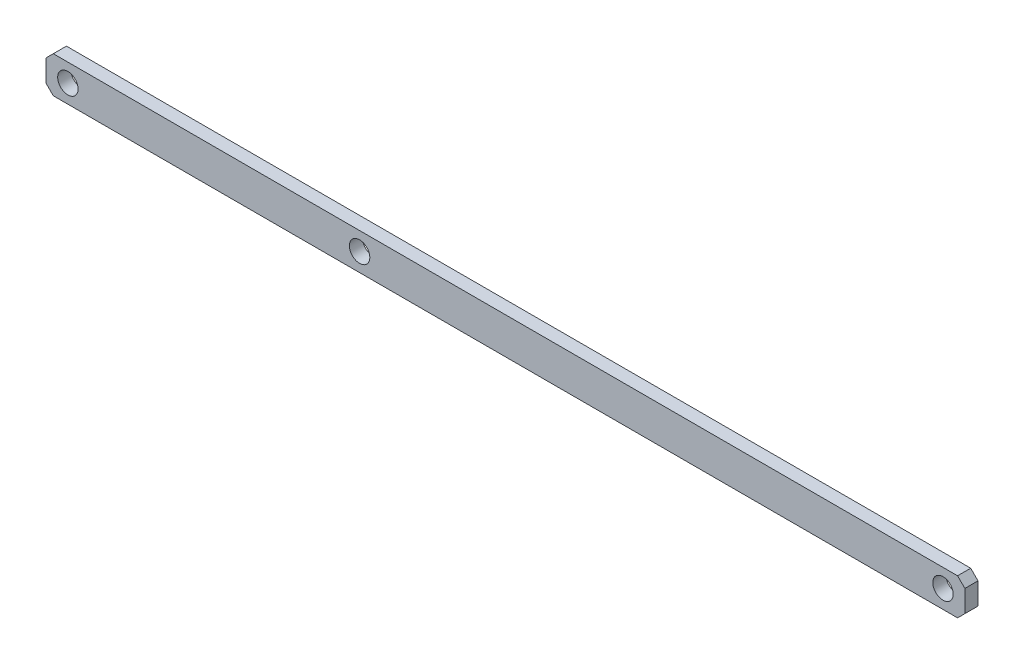
ISO-10303-21;
HEADER;
FILE_DESCRIPTION(('STEP AP214'),'2;1');
FILE_NAME('part.step','',(''),(''),'','','');
FILE_SCHEMA(('AUTOMOTIVE_DESIGN { 1 0 10303 214 1 1 1 1 }'));
ENDSEC;
DATA;
#1=APPLICATION_CONTEXT('core data for automotive mechanical design processes');
#2=APPLICATION_PROTOCOL_DEFINITION('international standard','automotive_design',2000,#1);
#3=PRODUCT_CONTEXT('',#1,'mechanical');
#4=PRODUCT('Part','Part','',(#3));
#5=PRODUCT_RELATED_PRODUCT_CATEGORY('part','',(#4));
#6=PRODUCT_DEFINITION_FORMATION('','',#4);
#7=PRODUCT_DEFINITION_CONTEXT('part definition',#1,'design');
#8=PRODUCT_DEFINITION('design','',#6,#7);
#9=PRODUCT_DEFINITION_SHAPE('','',#8);
#10=(LENGTH_UNIT() NAMED_UNIT(*) SI_UNIT(.MILLI.,.METRE.));
#11=(NAMED_UNIT(*) PLANE_ANGLE_UNIT() SI_UNIT($,.RADIAN.));
#12=(NAMED_UNIT(*) SI_UNIT($,.STERADIAN.) SOLID_ANGLE_UNIT());
#13=UNCERTAINTY_MEASURE_WITH_UNIT(LENGTH_MEASURE(1.E-05),#10,'distance_accuracy_value','');
#14=(GEOMETRIC_REPRESENTATION_CONTEXT(3) GLOBAL_UNCERTAINTY_ASSIGNED_CONTEXT((#13)) GLOBAL_UNIT_ASSIGNED_CONTEXT((#10,
#11,#12)) REPRESENTATION_CONTEXT('',''));
#15=CARTESIAN_POINT('',(0.,0.,0.));
#16=DIRECTION('',(0.,0.,1.));
#17=DIRECTION('',(1.,0.,0.));
#18=AXIS2_PLACEMENT_3D('',#15,#16,#17);
#19=CARTESIAN_POINT('',(0.,0.,4.5));
#20=DIRECTION('',(0.,0.,-1.));
#21=DIRECTION('',(-1.,0.,0.));
#22=AXIS2_PLACEMENT_3D('',#19,#20,#21);
#23=PLANE('',#22);
#24=DIRECTION('',(0.707106781186548,-0.707106781186547,0.));
#25=VECTOR('',#24,1.);
#26=CARTESIAN_POINT('',(-210.,-12.5,4.5));
#27=LINE('',#26,#25);
#28=CARTESIAN_POINT('',(-215.,-7.5,4.5));
#29=VERTEX_POINT('',#28);
#30=CARTESIAN_POINT('',(-210.,-12.5,4.5));
#31=VERTEX_POINT('',#30);
#32=EDGE_CURVE('E145',#29,#31,#27,.T.);
#33=ORIENTED_EDGE('',*,*,#32,.T.);
#34=DIRECTION('',(1.,0.,0.));
#35=VECTOR('',#34,1.);
#36=CARTESIAN_POINT('',(-210.,-12.5,4.5));
#37=LINE('',#36,#35);
#38=CARTESIAN_POINT('',(410.,-12.5,4.5));
#39=VERTEX_POINT('',#38);
#40=EDGE_CURVE('E93',#31,#39,#37,.T.);
#41=ORIENTED_EDGE('',*,*,#40,.T.);
#42=DIRECTION('',(0.707106781186552,0.707106781186543,0.));
#43=VECTOR('',#42,1.);
#44=CARTESIAN_POINT('',(410.,-12.5,4.5));
#45=LINE('',#44,#43);
#46=CARTESIAN_POINT('',(415.,-7.5,4.5));
#47=VERTEX_POINT('',#46);
#48=EDGE_CURVE('E160',#39,#47,#45,.T.);
#49=ORIENTED_EDGE('',*,*,#48,.T.);
#50=DIRECTION('',(0.,1.,0.));
#51=VECTOR('',#50,1.);
#52=CARTESIAN_POINT('',(415.,-7.5,4.5));
#53=LINE('',#52,#51);
#54=CARTESIAN_POINT('',(415.,7.5,4.5));
#55=VERTEX_POINT('',#54);
#56=EDGE_CURVE('E173',#47,#55,#53,.T.);
#57=ORIENTED_EDGE('',*,*,#56,.T.);
#58=DIRECTION('',(-0.707106781186552,0.707106781186543,0.));
#59=VECTOR('',#58,1.);
#60=CARTESIAN_POINT('',(410.,12.5,4.5));
#61=LINE('',#60,#59);
#62=CARTESIAN_POINT('',(410.,12.5,4.5));
#63=VERTEX_POINT('',#62);
#64=EDGE_CURVE('E112',#55,#63,#61,.T.);
#65=ORIENTED_EDGE('',*,*,#64,.T.);
#66=DIRECTION('',(-1.,0.,0.));
#67=VECTOR('',#66,1.);
#68=CARTESIAN_POINT('',(-210.,12.5,4.5));
#69=LINE('',#68,#67);
#70=CARTESIAN_POINT('',(-210.,12.5,4.5));
#71=VERTEX_POINT('',#70);
#72=EDGE_CURVE('E106',#63,#71,#69,.T.);
#73=ORIENTED_EDGE('',*,*,#72,.T.);
#74=DIRECTION('',(-0.707106781186548,-0.707106781186547,0.));
#75=VECTOR('',#74,1.);
#76=CARTESIAN_POINT('',(-215.,7.5,4.5));
#77=LINE('',#76,#75);
#78=CARTESIAN_POINT('',(-215.,7.5,4.5));
#79=VERTEX_POINT('',#78);
#80=EDGE_CURVE('E110',#71,#79,#77,.T.);
#81=ORIENTED_EDGE('',*,*,#80,.T.);
#82=DIRECTION('',(0.,-1.,0.));
#83=VECTOR('',#82,1.);
#84=CARTESIAN_POINT('',(-215.,-7.5,4.5));
#85=LINE('',#84,#83);
#86=EDGE_CURVE('E50',#79,#29,#85,.T.);
#87=ORIENTED_EDGE('',*,*,#86,.T.);
#88=EDGE_LOOP('',(#33,#41,#49,#57,#65,#73,#81,#87));
#89=FACE_BOUND('',#88,.T.);
#90=CARTESIAN_POINT('',(0.,0.,4.5));
#91=DIRECTION('',(0.,0.,1.));
#92=DIRECTION('',(1.,0.,0.));
#93=AXIS2_PLACEMENT_3D('',#90,#91,#92);
#94=CIRCLE('',#93,7.);
#95=CARTESIAN_POINT('',(7.,0.,4.5));
#96=VERTEX_POINT('',#95);
#97=EDGE_CURVE('E134',#96,#96,#94,.T.);
#98=ORIENTED_EDGE('',*,*,#97,.F.);
#99=EDGE_LOOP('',(#98));
#100=FACE_BOUND('',#99,.T.);
#101=CARTESIAN_POINT('',(400.,0.,4.5));
#102=DIRECTION('',(0.,0.,1.));
#103=DIRECTION('',(1.,0.,0.));
#104=AXIS2_PLACEMENT_3D('',#101,#102,#103);
#105=CIRCLE('',#104,6.99999999999999);
#106=CARTESIAN_POINT('',(407.,0.,4.5));
#107=VERTEX_POINT('',#106);
#108=EDGE_CURVE('E182',#107,#107,#105,.T.);
#109=ORIENTED_EDGE('',*,*,#108,.F.);
#110=EDGE_LOOP('',(#109));
#111=FACE_BOUND('',#110,.T.);
#112=CARTESIAN_POINT('',(-200.,0.,4.5));
#113=DIRECTION('',(0.,0.,1.));
#114=DIRECTION('',(1.,0.,0.));
#115=AXIS2_PLACEMENT_3D('',#112,#113,#114);
#116=CIRCLE('',#115,7.00000000000001);
#117=CARTESIAN_POINT('',(-193.,0.,4.5));
#118=VERTEX_POINT('',#117);
#119=EDGE_CURVE('E188',#118,#118,#116,.T.);
#120=ORIENTED_EDGE('',*,*,#119,.F.);
#121=EDGE_LOOP('',(#120));
#122=FACE_BOUND('',#121,.T.);
#123=ADVANCED_FACE('F33',(#89,#100,#111,#122),#23,.F.);
#124=CARTESIAN_POINT('',(0.,0.,-4.5));
#125=DIRECTION('',(0.,0.,-1.));
#126=DIRECTION('',(-1.,0.,0.));
#127=AXIS2_PLACEMENT_3D('',#124,#125,#126);
#128=PLANE('',#127);
#129=CARTESIAN_POINT('',(400.,0.,-4.5));
#130=DIRECTION('',(0.,0.,1.));
#131=DIRECTION('',(1.,0.,0.));
#132=AXIS2_PLACEMENT_3D('',#129,#130,#131);
#133=CIRCLE('',#132,6.99999999999999);
#134=CARTESIAN_POINT('',(407.,0.,-4.5));
#135=VERTEX_POINT('',#134);
#136=EDGE_CURVE('E185',#135,#135,#133,.T.);
#137=ORIENTED_EDGE('',*,*,#136,.T.);
#138=EDGE_LOOP('',(#137));
#139=FACE_BOUND('',#138,.T.);
#140=DIRECTION('',(0.707106781186548,-0.707106781186547,0.));
#141=VECTOR('',#140,1.);
#142=CARTESIAN_POINT('',(-210.,-12.5,-4.5));
#143=LINE('',#142,#141);
#144=CARTESIAN_POINT('',(-215.,-7.5,-4.5));
#145=VERTEX_POINT('',#144);
#146=CARTESIAN_POINT('',(-210.,-12.5,-4.5));
#147=VERTEX_POINT('',#146);
#148=EDGE_CURVE('E130',#145,#147,#143,.T.);
#149=ORIENTED_EDGE('',*,*,#148,.F.);
#150=DIRECTION('',(0.,-1.,0.));
#151=VECTOR('',#150,1.);
#152=CARTESIAN_POINT('',(-215.,-7.5,-4.5));
#153=LINE('',#152,#151);
#154=CARTESIAN_POINT('',(-215.,7.5,-4.5));
#155=VERTEX_POINT('',#154);
#156=EDGE_CURVE('E85',#155,#145,#153,.T.);
#157=ORIENTED_EDGE('',*,*,#156,.F.);
#158=DIRECTION('',(-0.707106781186548,-0.707106781186547,0.));
#159=VECTOR('',#158,1.);
#160=CARTESIAN_POINT('',(-215.,7.5,-4.5));
#161=LINE('',#160,#159);
#162=CARTESIAN_POINT('',(-210.,12.5,-4.5));
#163=VERTEX_POINT('',#162);
#164=EDGE_CURVE('E79',#163,#155,#161,.T.);
#165=ORIENTED_EDGE('',*,*,#164,.F.);
#166=DIRECTION('',(-1.,0.,0.));
#167=VECTOR('',#166,1.);
#168=CARTESIAN_POINT('',(-210.,12.5,-4.5));
#169=LINE('',#168,#167);
#170=CARTESIAN_POINT('',(410.,12.5,-4.5));
#171=VERTEX_POINT('',#170);
#172=EDGE_CURVE('E120',#171,#163,#169,.T.);
#173=ORIENTED_EDGE('',*,*,#172,.F.);
#174=DIRECTION('',(-0.707106781186552,0.707106781186543,0.));
#175=VECTOR('',#174,1.);
#176=CARTESIAN_POINT('',(410.,12.5,-4.5));
#177=LINE('',#176,#175);
#178=CARTESIAN_POINT('',(415.,7.5,-4.5));
#179=VERTEX_POINT('',#178);
#180=EDGE_CURVE('E140',#179,#171,#177,.T.);
#181=ORIENTED_EDGE('',*,*,#180,.F.);
#182=DIRECTION('',(0.,1.,0.));
#183=VECTOR('',#182,1.);
#184=CARTESIAN_POINT('',(415.,-7.5,-4.5));
#185=LINE('',#184,#183);
#186=CARTESIAN_POINT('',(415.,-7.5,-4.5));
#187=VERTEX_POINT('',#186);
#188=EDGE_CURVE('E138',#187,#179,#185,.T.);
#189=ORIENTED_EDGE('',*,*,#188,.F.);
#190=DIRECTION('',(0.707106781186552,0.707106781186543,0.));
#191=VECTOR('',#190,1.);
#192=CARTESIAN_POINT('',(410.,-12.5,-4.5));
#193=LINE('',#192,#191);
#194=CARTESIAN_POINT('',(410.,-12.5,-4.5));
#195=VERTEX_POINT('',#194);
#196=EDGE_CURVE('E136',#195,#187,#193,.T.);
#197=ORIENTED_EDGE('',*,*,#196,.F.);
#198=DIRECTION('',(1.,0.,0.));
#199=VECTOR('',#198,1.);
#200=CARTESIAN_POINT('',(-210.,-12.5,-4.5));
#201=LINE('',#200,#199);
#202=EDGE_CURVE('E133',#147,#195,#201,.T.);
#203=ORIENTED_EDGE('',*,*,#202,.F.);
#204=EDGE_LOOP('',(#149,#157,#165,#173,#181,#189,#197,#203));
#205=FACE_BOUND('',#204,.T.);
#206=CARTESIAN_POINT('',(0.,0.,-4.5));
#207=DIRECTION('',(0.,0.,1.));
#208=DIRECTION('',(1.,0.,0.));
#209=AXIS2_PLACEMENT_3D('',#206,#207,#208);
#210=CIRCLE('',#209,7.);
#211=CARTESIAN_POINT('',(7.,0.,-4.5));
#212=VERTEX_POINT('',#211);
#213=EDGE_CURVE('E179',#212,#212,#210,.T.);
#214=ORIENTED_EDGE('',*,*,#213,.T.);
#215=EDGE_LOOP('',(#214));
#216=FACE_BOUND('',#215,.T.);
#217=CARTESIAN_POINT('',(-200.,0.,-4.5));
#218=DIRECTION('',(0.,0.,1.));
#219=DIRECTION('',(1.,0.,0.));
#220=AXIS2_PLACEMENT_3D('',#217,#218,#219);
#221=CIRCLE('',#220,7.00000000000001);
#222=CARTESIAN_POINT('',(-193.,0.,-4.5));
#223=VERTEX_POINT('',#222);
#224=EDGE_CURVE('E191',#223,#223,#221,.T.);
#225=ORIENTED_EDGE('',*,*,#224,.T.);
#226=EDGE_LOOP('',(#225));
#227=FACE_BOUND('',#226,.T.);
#228=ADVANCED_FACE('F164',(#139,#205,#216,#227),#128,.T.);
#229=CARTESIAN_POINT('',(-210.,-12.5,4.5));
#230=DIRECTION('',(0.707106781186547,0.707106781186548,0.));
#231=DIRECTION('',(-0.707106781186548,0.707106781186547,0.));
#232=AXIS2_PLACEMENT_3D('',#229,#230,#231);
#233=PLANE('',#232);
#234=ORIENTED_EDGE('',*,*,#148,.T.);
#235=DIRECTION('',(0.,0.,-1.));
#236=VECTOR('',#235,1.);
#237=CARTESIAN_POINT('',(-210.,-12.5,4.5));
#238=LINE('',#237,#236);
#239=EDGE_CURVE('E11',#31,#147,#238,.T.);
#240=ORIENTED_EDGE('',*,*,#239,.F.);
#241=ORIENTED_EDGE('',*,*,#32,.F.);
#242=DIRECTION('',(0.,0.,-1.));
#243=VECTOR('',#242,1.);
#244=CARTESIAN_POINT('',(-215.,-7.5,4.5));
#245=LINE('',#244,#243);
#246=EDGE_CURVE('E126',#29,#145,#245,.T.);
#247=ORIENTED_EDGE('',*,*,#246,.T.);
#248=EDGE_LOOP('',(#234,#240,#241,#247));
#249=FACE_BOUND('',#248,.T.);
#250=ADVANCED_FACE('F35',(#249),#233,.F.);
#251=CARTESIAN_POINT('',(-210.,-12.5,4.5));
#252=DIRECTION('',(0.,1.,0.));
#253=DIRECTION('',(0.,0.,1.));
#254=AXIS2_PLACEMENT_3D('',#251,#252,#253);
#255=PLANE('',#254);
#256=ORIENTED_EDGE('',*,*,#202,.T.);
#257=DIRECTION('',(0.,0.,-1.));
#258=VECTOR('',#257,1.);
#259=CARTESIAN_POINT('',(410.,-12.5,4.5));
#260=LINE('',#259,#258);
#261=EDGE_CURVE('E42',#39,#195,#260,.T.);
#262=ORIENTED_EDGE('',*,*,#261,.F.);
#263=ORIENTED_EDGE('',*,*,#40,.F.);
#264=ORIENTED_EDGE('',*,*,#239,.T.);
#265=EDGE_LOOP('',(#256,#262,#263,#264));
#266=FACE_BOUND('',#265,.T.);
#267=ADVANCED_FACE('F223',(#266),#255,.F.);
#268=CARTESIAN_POINT('',(410.,-12.5,4.5));
#269=DIRECTION('',(-0.707106781186543,0.707106781186552,0.));
#270=DIRECTION('',(-0.707106781186552,-0.707106781186543,0.));
#271=AXIS2_PLACEMENT_3D('',#268,#269,#270);
#272=PLANE('',#271);
#273=ORIENTED_EDGE('',*,*,#196,.T.);
#274=DIRECTION('',(0.,0.,-1.));
#275=VECTOR('',#274,1.);
#276=CARTESIAN_POINT('',(415.,-7.5,4.5));
#277=LINE('',#276,#275);
#278=EDGE_CURVE('E152',#47,#187,#277,.T.);
#279=ORIENTED_EDGE('',*,*,#278,.F.);
#280=ORIENTED_EDGE('',*,*,#48,.F.);
#281=ORIENTED_EDGE('',*,*,#261,.T.);
#282=EDGE_LOOP('',(#273,#279,#280,#281));
#283=FACE_BOUND('',#282,.T.);
#284=ADVANCED_FACE('F158',(#283),#272,.F.);
#285=CARTESIAN_POINT('',(415.,-7.5,4.5));
#286=DIRECTION('',(-1.,0.,0.));
#287=DIRECTION('',(0.,0.,1.));
#288=AXIS2_PLACEMENT_3D('',#285,#286,#287);
#289=PLANE('',#288);
#290=ORIENTED_EDGE('',*,*,#188,.T.);
#291=DIRECTION('',(0.,0.,-1.));
#292=VECTOR('',#291,1.);
#293=CARTESIAN_POINT('',(415.,7.5,4.5));
#294=LINE('',#293,#292);
#295=EDGE_CURVE('E149',#55,#179,#294,.T.);
#296=ORIENTED_EDGE('',*,*,#295,.F.);
#297=ORIENTED_EDGE('',*,*,#56,.F.);
#298=ORIENTED_EDGE('',*,*,#278,.T.);
#299=EDGE_LOOP('',(#290,#296,#297,#298));
#300=FACE_BOUND('',#299,.T.);
#301=ADVANCED_FACE('F169',(#300),#289,.F.);
#302=CARTESIAN_POINT('',(410.,12.5,4.5));
#303=DIRECTION('',(-0.707106781186543,-0.707106781186552,0.));
#304=DIRECTION('',(0.707106781186552,-0.707106781186543,0.));
#305=AXIS2_PLACEMENT_3D('',#302,#303,#304);
#306=PLANE('',#305);
#307=ORIENTED_EDGE('',*,*,#180,.T.);
#308=DIRECTION('',(0.,0.,-1.));
#309=VECTOR('',#308,1.);
#310=CARTESIAN_POINT('',(410.,12.5,4.5));
#311=LINE('',#310,#309);
#312=EDGE_CURVE('E121',#63,#171,#311,.T.);
#313=ORIENTED_EDGE('',*,*,#312,.F.);
#314=ORIENTED_EDGE('',*,*,#64,.F.);
#315=ORIENTED_EDGE('',*,*,#295,.T.);
#316=EDGE_LOOP('',(#307,#313,#314,#315));
#317=FACE_BOUND('',#316,.T.);
#318=ADVANCED_FACE('F172',(#317),#306,.F.);
#319=CARTESIAN_POINT('',(-210.,12.5,4.5));
#320=DIRECTION('',(0.,-1.,0.));
#321=DIRECTION('',(0.,0.,-1.));
#322=AXIS2_PLACEMENT_3D('',#319,#320,#321);
#323=PLANE('',#322);
#324=ORIENTED_EDGE('',*,*,#172,.T.);
#325=DIRECTION('',(0.,0.,-1.));
#326=VECTOR('',#325,1.);
#327=CARTESIAN_POINT('',(-210.,12.5,4.5));
#328=LINE('',#327,#326);
#329=EDGE_CURVE('E117',#71,#163,#328,.T.);
#330=ORIENTED_EDGE('',*,*,#329,.F.);
#331=ORIENTED_EDGE('',*,*,#72,.F.);
#332=ORIENTED_EDGE('',*,*,#312,.T.);
#333=EDGE_LOOP('',(#324,#330,#331,#332));
#334=FACE_BOUND('',#333,.T.);
#335=ADVANCED_FACE('F118',(#334),#323,.F.);
#336=CARTESIAN_POINT('',(-215.,7.5,4.5));
#337=DIRECTION('',(0.707106781186547,-0.707106781186548,0.));
#338=DIRECTION('',(0.707106781186548,0.707106781186547,0.));
#339=AXIS2_PLACEMENT_3D('',#336,#337,#338);
#340=PLANE('',#339);
#341=ORIENTED_EDGE('',*,*,#164,.T.);
#342=DIRECTION('',(0.,0.,-1.));
#343=VECTOR('',#342,1.);
#344=CARTESIAN_POINT('',(-215.,7.5,4.5));
#345=LINE('',#344,#343);
#346=EDGE_CURVE('E122',#79,#155,#345,.T.);
#347=ORIENTED_EDGE('',*,*,#346,.F.);
#348=ORIENTED_EDGE('',*,*,#80,.F.);
#349=ORIENTED_EDGE('',*,*,#329,.T.);
#350=EDGE_LOOP('',(#341,#347,#348,#349));
#351=FACE_BOUND('',#350,.T.);
#352=ADVANCED_FACE('F124',(#351),#340,.F.);
#353=CARTESIAN_POINT('',(-215.,-7.5,4.5));
#354=DIRECTION('',(1.,0.,0.));
#355=DIRECTION('',(0.,0.,-1.));
#356=AXIS2_PLACEMENT_3D('',#353,#354,#355);
#357=PLANE('',#356);
#358=ORIENTED_EDGE('',*,*,#156,.T.);
#359=ORIENTED_EDGE('',*,*,#246,.F.);
#360=ORIENTED_EDGE('',*,*,#86,.F.);
#361=ORIENTED_EDGE('',*,*,#346,.T.);
#362=EDGE_LOOP('',(#358,#359,#360,#361));
#363=FACE_BOUND('',#362,.T.);
#364=ADVANCED_FACE('F211',(#363),#357,.F.);
#365=CARTESIAN_POINT('',(0.,0.,4.5));
#366=DIRECTION('',(0.,0.,-1.));
#367=DIRECTION('',(-1.,0.,0.));
#368=AXIS2_PLACEMENT_3D('',#365,#366,#367);
#369=CYLINDRICAL_SURFACE('',#368,7.);
#370=ORIENTED_EDGE('',*,*,#97,.T.);
#371=EDGE_LOOP('',(#370));
#372=FACE_BOUND('',#371,.T.);
#373=ORIENTED_EDGE('',*,*,#213,.F.);
#374=EDGE_LOOP('',(#373));
#375=FACE_BOUND('',#374,.T.);
#376=ADVANCED_FACE('F208',(#372,#375),#369,.F.);
#377=CARTESIAN_POINT('',(400.,0.,4.5));
#378=DIRECTION('',(0.,0.,-1.));
#379=DIRECTION('',(-1.,0.,0.));
#380=AXIS2_PLACEMENT_3D('',#377,#378,#379);
#381=CYLINDRICAL_SURFACE('',#380,6.99999999999999);
#382=ORIENTED_EDGE('',*,*,#108,.T.);
#383=EDGE_LOOP('',(#382));
#384=FACE_BOUND('',#383,.T.);
#385=ORIENTED_EDGE('',*,*,#136,.F.);
#386=EDGE_LOOP('',(#385));
#387=FACE_BOUND('',#386,.T.);
#388=ADVANCED_FACE('F287',(#384,#387),#381,.F.);
#389=CARTESIAN_POINT('',(-200.,0.,4.5));
#390=DIRECTION('',(0.,0.,-1.));
#391=DIRECTION('',(-1.,0.,0.));
#392=AXIS2_PLACEMENT_3D('',#389,#390,#391);
#393=CYLINDRICAL_SURFACE('',#392,7.00000000000001);
#394=ORIENTED_EDGE('',*,*,#119,.T.);
#395=EDGE_LOOP('',(#394));
#396=FACE_BOUND('',#395,.T.);
#397=ORIENTED_EDGE('',*,*,#224,.F.);
#398=EDGE_LOOP('',(#397));
#399=FACE_BOUND('',#398,.T.);
#400=ADVANCED_FACE('F197',(#396,#399),#393,.F.);
#401=CLOSED_SHELL('',(#123,#228,#250,#267,#284,#301,#318,#335,#352,#364,#376,#388,#400));
#402=MANIFOLD_SOLID_BREP('B2',#401);
#403=ADVANCED_BREP_SHAPE_REPRESENTATION('',(#18,#402),#14);
#404=SHAPE_DEFINITION_REPRESENTATION(#9,#403);
ENDSEC;
END-ISO-10303-21;
